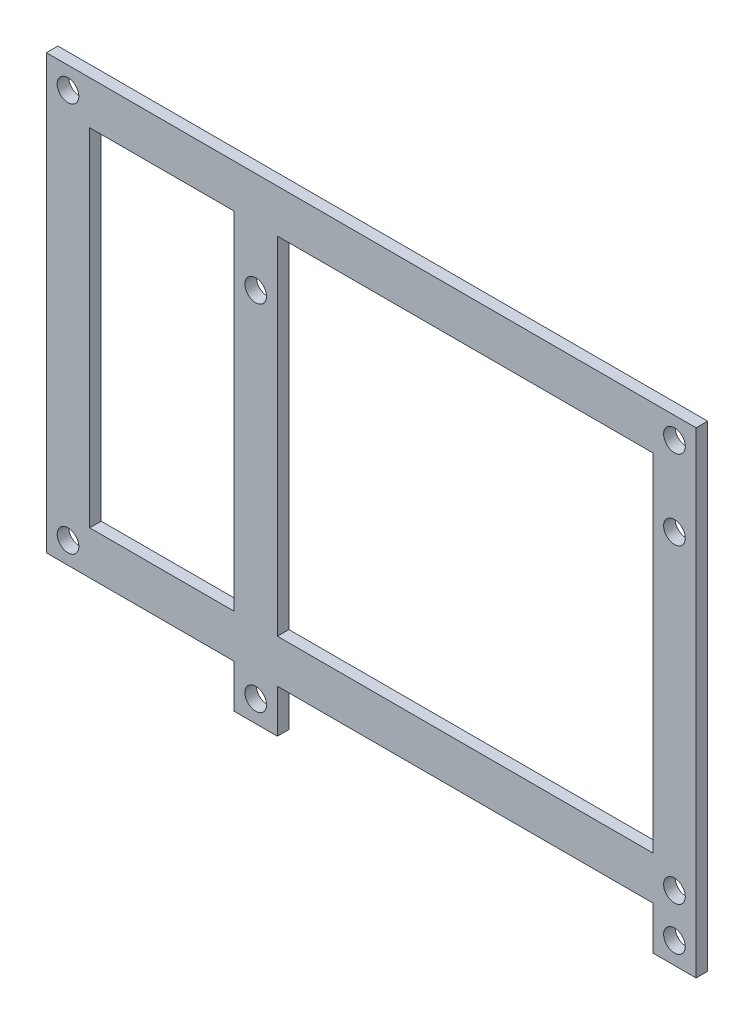
ISO-10303-21;
HEADER;
FILE_DESCRIPTION(('STEP AP214'),'2;1');
FILE_NAME('part.step','',(''),(''),'','','');
FILE_SCHEMA(('AUTOMOTIVE_DESIGN { 1 0 10303 214 1 1 1 1 }'));
ENDSEC;
DATA;
#1=APPLICATION_CONTEXT('core data for automotive mechanical design processes');
#2=APPLICATION_PROTOCOL_DEFINITION('international standard','automotive_design',2000,#1);
#3=PRODUCT_CONTEXT('',#1,'mechanical');
#4=PRODUCT('Part','Part','',(#3));
#5=PRODUCT_RELATED_PRODUCT_CATEGORY('part','',(#4));
#6=PRODUCT_DEFINITION_FORMATION('','',#4);
#7=PRODUCT_DEFINITION_CONTEXT('part definition',#1,'design');
#8=PRODUCT_DEFINITION('design','',#6,#7);
#9=PRODUCT_DEFINITION_SHAPE('','',#8);
#10=(LENGTH_UNIT() NAMED_UNIT(*) SI_UNIT(.MILLI.,.METRE.));
#11=(NAMED_UNIT(*) PLANE_ANGLE_UNIT() SI_UNIT($,.RADIAN.));
#12=(NAMED_UNIT(*) SI_UNIT($,.STERADIAN.) SOLID_ANGLE_UNIT());
#13=UNCERTAINTY_MEASURE_WITH_UNIT(LENGTH_MEASURE(1.E-05),#10,'distance_accuracy_value','');
#14=(GEOMETRIC_REPRESENTATION_CONTEXT(3) GLOBAL_UNCERTAINTY_ASSIGNED_CONTEXT((#13)) GLOBAL_UNIT_ASSIGNED_CONTEXT((#10,
#11,#12)) REPRESENTATION_CONTEXT('',''));
#15=CARTESIAN_POINT('',(0.,0.,0.));
#16=DIRECTION('',(0.,0.,1.));
#17=DIRECTION('',(1.,0.,0.));
#18=AXIS2_PLACEMENT_3D('',#15,#16,#17);
#19=CARTESIAN_POINT('',(-80.5873998938069,29.746992481203,0.));
#20=DIRECTION('',(0.,1.,0.));
#21=DIRECTION('',(0.,0.,1.));
#22=AXIS2_PLACEMENT_3D('',#19,#20,#21);
#23=PLANE('',#22);
#24=DIRECTION('',(-1.,0.,0.));
#25=VECTOR('',#24,1.);
#26=CARTESIAN_POINT('',(-80.5873998938069,29.746992481203,0.));
#27=LINE('',#26,#25);
#28=CARTESIAN_POINT('',(-60.5873998938069,29.746992481203,0.));
#29=VERTEX_POINT('',#28);
#30=CARTESIAN_POINT('',(-80.5873998938069,29.746992481203,0.));
#31=VERTEX_POINT('',#30);
#32=EDGE_CURVE('E51',#29,#31,#27,.T.);
#33=ORIENTED_EDGE('',*,*,#32,.F.);
#34=DIRECTION('',(0.,0.,1.));
#35=VECTOR('',#34,1.);
#36=CARTESIAN_POINT('',(-60.5873998938069,29.746992481203,0.));
#37=LINE('',#36,#35);
#38=CARTESIAN_POINT('',(-60.5873998938069,29.746992481203,1.59999999999994));
#39=VERTEX_POINT('',#38);
#40=EDGE_CURVE('E199',#29,#39,#37,.T.);
#41=ORIENTED_EDGE('',*,*,#40,.T.);
#42=DIRECTION('',(-1.,0.,0.));
#43=VECTOR('',#42,1.);
#44=CARTESIAN_POINT('',(-80.5873998938069,29.746992481203,1.59999999999994));
#45=LINE('',#44,#43);
#46=CARTESIAN_POINT('',(-80.5873998938069,29.746992481203,1.59999999999994));
#47=VERTEX_POINT('',#46);
#48=EDGE_CURVE('E266',#39,#47,#45,.T.);
#49=ORIENTED_EDGE('',*,*,#48,.T.);
#50=DIRECTION('',(0.,0.,1.));
#51=VECTOR('',#50,1.);
#52=CARTESIAN_POINT('',(-80.5873998938069,29.746992481203,0.));
#53=LINE('',#52,#51);
#54=EDGE_CURVE('E268',#31,#47,#53,.T.);
#55=ORIENTED_EDGE('',*,*,#54,.F.);
#56=EDGE_LOOP('',(#33,#41,#49,#55));
#57=FACE_BOUND('',#56,.T.);
#58=ADVANCED_FACE('F36',(#57),#23,.F.);
#59=CARTESIAN_POINT('',(-80.5873998938069,-18.253007518797,0.));
#60=DIRECTION('',(0.,-1.,0.));
#61=DIRECTION('',(0.,0.,-1.));
#62=AXIS2_PLACEMENT_3D('',#59,#60,#61);
#63=PLANE('',#62);
#64=DIRECTION('',(1.,0.,0.));
#65=VECTOR('',#64,1.);
#66=CARTESIAN_POINT('',(-80.5873998938069,-18.253007518797,1.59999999999994));
#67=LINE('',#66,#65);
#68=CARTESIAN_POINT('',(-80.5873998938069,-18.253007518797,1.59999999999994));
#69=VERTEX_POINT('',#68);
#70=CARTESIAN_POINT('',(-60.5873998938069,-18.253007518797,1.59999999999994));
#71=VERTEX_POINT('',#70);
#72=EDGE_CURVE('E175',#69,#71,#67,.T.);
#73=ORIENTED_EDGE('',*,*,#72,.T.);
#74=DIRECTION('',(0.,0.,1.));
#75=VECTOR('',#74,1.);
#76=CARTESIAN_POINT('',(-60.5873998938069,-18.253007518797,0.));
#77=LINE('',#76,#75);
#78=CARTESIAN_POINT('',(-60.5873998938069,-18.253007518797,0.));
#79=VERTEX_POINT('',#78);
#80=EDGE_CURVE('E185',#79,#71,#77,.T.);
#81=ORIENTED_EDGE('',*,*,#80,.F.);
#82=DIRECTION('',(1.,0.,0.));
#83=VECTOR('',#82,1.);
#84=CARTESIAN_POINT('',(-80.5873998938069,-18.253007518797,0.));
#85=LINE('',#84,#83);
#86=CARTESIAN_POINT('',(-80.5873998938069,-18.253007518797,0.));
#87=VERTEX_POINT('',#86);
#88=EDGE_CURVE('E255',#87,#79,#85,.T.);
#89=ORIENTED_EDGE('',*,*,#88,.F.);
#90=DIRECTION('',(0.,0.,1.));
#91=VECTOR('',#90,1.);
#92=CARTESIAN_POINT('',(-80.5873998938069,-18.253007518797,0.));
#93=LINE('',#92,#91);
#94=EDGE_CURVE('E263',#87,#69,#93,.T.);
#95=ORIENTED_EDGE('',*,*,#94,.T.);
#96=EDGE_LOOP('',(#73,#81,#89,#95));
#97=FACE_BOUND('',#96,.T.);
#98=ADVANCED_FACE('F416',(#97),#63,.F.);
#99=CARTESIAN_POINT('',(-86.5873998938069,-24.253007518797,1.59999999999994));
#100=DIRECTION('',(0.,1.,0.));
#101=DIRECTION('',(0.,0.,1.));
#102=AXIS2_PLACEMENT_3D('',#99,#100,#101);
#103=PLANE('',#102);
#104=DIRECTION('',(1.,0.,0.));
#105=VECTOR('',#104,1.);
#106=CARTESIAN_POINT('',(-86.5873998938069,-24.253007518797,0.));
#107=LINE('',#106,#105);
#108=CARTESIAN_POINT('',(-86.5873998938069,-24.253007518797,0.));
#109=VERTEX_POINT('',#108);
#110=CARTESIAN_POINT('',(-60.5873998938069,-24.253007518797,0.));
#111=VERTEX_POINT('',#110);
#112=EDGE_CURVE('E339',#109,#111,#107,.T.);
#113=ORIENTED_EDGE('',*,*,#112,.T.);
#114=DIRECTION('',(0.,0.,1.));
#115=VECTOR('',#114,1.);
#116=CARTESIAN_POINT('',(-60.5873998938069,-24.253007518797,0.));
#117=LINE('',#116,#115);
#118=CARTESIAN_POINT('',(-60.5873998938069,-24.253007518797,1.59999999999994));
#119=VERTEX_POINT('',#118);
#120=EDGE_CURVE('E223',#111,#119,#117,.T.);
#121=ORIENTED_EDGE('',*,*,#120,.T.);
#122=DIRECTION('',(1.,0.,0.));
#123=VECTOR('',#122,1.);
#124=CARTESIAN_POINT('',(-86.5873998938069,-24.253007518797,1.59999999999994));
#125=LINE('',#124,#123);
#126=CARTESIAN_POINT('',(-86.5873998938069,-24.253007518797,1.59999999999994));
#127=VERTEX_POINT('',#126);
#128=EDGE_CURVE('E388',#127,#119,#125,.T.);
#129=ORIENTED_EDGE('',*,*,#128,.F.);
#130=DIRECTION('',(0.,0.,-1.));
#131=VECTOR('',#130,1.);
#132=CARTESIAN_POINT('',(-86.5873998938069,-24.253007518797,1.59999999999994));
#133=LINE('',#132,#131);
#134=EDGE_CURVE('E12',#127,#109,#133,.T.);
#135=ORIENTED_EDGE('',*,*,#134,.T.);
#136=EDGE_LOOP('',(#113,#121,#129,#135));
#137=FACE_BOUND('',#136,.T.);
#138=ADVANCED_FACE('F394',(#137),#103,.F.);
#139=CARTESIAN_POINT('',(-86.5873998938069,35.746992481203,1.59999999999994));
#140=DIRECTION('',(1.,0.,0.));
#141=DIRECTION('',(0.,1.,0.));
#142=AXIS2_PLACEMENT_3D('',#139,#140,#141);
#143=PLANE('',#142);
#144=DIRECTION('',(0.,-1.,0.));
#145=VECTOR('',#144,1.);
#146=CARTESIAN_POINT('',(-86.5873998938069,35.746992481203,0.));
#147=LINE('',#146,#145);
#148=CARTESIAN_POINT('',(-86.5873998938069,35.746992481203,0.));
#149=VERTEX_POINT('',#148);
#150=EDGE_CURVE('E303',#149,#109,#147,.T.);
#151=ORIENTED_EDGE('',*,*,#150,.T.);
#152=ORIENTED_EDGE('',*,*,#134,.F.);
#153=DIRECTION('',(0.,-1.,0.));
#154=VECTOR('',#153,1.);
#155=CARTESIAN_POINT('',(-86.5873998938069,35.746992481203,1.59999999999994));
#156=LINE('',#155,#154);
#157=CARTESIAN_POINT('',(-86.5873998938069,35.746992481203,1.59999999999994));
#158=VERTEX_POINT('',#157);
#159=EDGE_CURVE('E308',#158,#127,#156,.T.);
#160=ORIENTED_EDGE('',*,*,#159,.F.);
#161=DIRECTION('',(0.,0.,-1.));
#162=VECTOR('',#161,1.);
#163=CARTESIAN_POINT('',(-86.5873998938069,35.746992481203,1.59999999999994));
#164=LINE('',#163,#162);
#165=EDGE_CURVE('E351',#158,#149,#164,.T.);
#166=ORIENTED_EDGE('',*,*,#165,.T.);
#167=EDGE_LOOP('',(#151,#152,#160,#166));
#168=FACE_BOUND('',#167,.T.);
#169=ADVANCED_FACE('F38',(#168),#143,.F.);
#170=CARTESIAN_POINT('',(-54.5873998938069,-24.253007518797,1.59999999999994));
#171=VERTEX_POINT('',#170);
#172=CARTESIAN_POINT('',(-2.58739989380696,-24.253007518797,1.59999999999994));
#173=VERTEX_POINT('',#172);
#174=EDGE_CURVE('E386',#171,#173,#125,.T.);
#175=ORIENTED_EDGE('',*,*,#174,.F.);
#176=DIRECTION('',(0.,0.,1.));
#177=VECTOR('',#176,1.);
#178=CARTESIAN_POINT('',(-54.5873998938069,-24.253007518797,0.));
#179=LINE('',#178,#177);
#180=CARTESIAN_POINT('',(-54.5873998938069,-24.253007518797,0.));
#181=VERTEX_POINT('',#180);
#182=EDGE_CURVE('E226',#181,#171,#179,.T.);
#183=ORIENTED_EDGE('',*,*,#182,.F.);
#184=CARTESIAN_POINT('',(-2.58739989380694,-24.253007518797,0.));
#185=VERTEX_POINT('',#184);
#186=EDGE_CURVE('E343',#181,#185,#107,.T.);
#187=ORIENTED_EDGE('',*,*,#186,.T.);
#188=DIRECTION('',(0.,0.,1.));
#189=VECTOR('',#188,1.);
#190=CARTESIAN_POINT('',(-2.58739989380694,-24.253007518797,0.));
#191=LINE('',#190,#189);
#192=EDGE_CURVE('E239',#185,#173,#191,.T.);
#193=ORIENTED_EDGE('',*,*,#192,.T.);
#194=EDGE_LOOP('',(#175,#183,#187,#193));
#195=FACE_BOUND('',#194,.T.);
#196=ADVANCED_FACE('F375',(#195),#103,.F.);
#197=CARTESIAN_POINT('',(3.41260010619306,35.746992481203,1.59999999999994));
#198=DIRECTION('',(-1.,0.,0.));
#199=DIRECTION('',(0.,0.,1.));
#200=AXIS2_PLACEMENT_3D('',#197,#198,#199);
#201=PLANE('',#200);
#202=DIRECTION('',(0.,1.,0.));
#203=VECTOR('',#202,1.);
#204=CARTESIAN_POINT('',(3.41260010619306,35.746992481203,0.));
#205=LINE('',#204,#203);
#206=CARTESIAN_POINT('',(3.41260010619306,-30.253007518797,0.));
#207=VERTEX_POINT('',#206);
#208=CARTESIAN_POINT('',(3.41260010619306,35.746992481203,0.));
#209=VERTEX_POINT('',#208);
#210=EDGE_CURVE('E342',#207,#209,#205,.T.);
#211=ORIENTED_EDGE('',*,*,#210,.T.);
#212=DIRECTION('',(0.,0.,-1.));
#213=VECTOR('',#212,1.);
#214=CARTESIAN_POINT('',(3.41260010619306,35.746992481203,1.59999999999994));
#215=LINE('',#214,#213);
#216=CARTESIAN_POINT('',(3.41260010619306,35.746992481203,1.59999999999994));
#217=VERTEX_POINT('',#216);
#218=EDGE_CURVE('E44',#217,#209,#215,.T.);
#219=ORIENTED_EDGE('',*,*,#218,.F.);
#220=DIRECTION('',(0.,1.,0.));
#221=VECTOR('',#220,1.);
#222=CARTESIAN_POINT('',(3.41260010619306,35.746992481203,1.59999999999994));
#223=LINE('',#222,#221);
#224=CARTESIAN_POINT('',(3.41260010619306,-30.253007518797,1.59999999999994));
#225=VERTEX_POINT('',#224);
#226=EDGE_CURVE('E390',#225,#217,#223,.T.);
#227=ORIENTED_EDGE('',*,*,#226,.F.);
#228=DIRECTION('',(0.,0.,1.));
#229=VECTOR('',#228,1.);
#230=CARTESIAN_POINT('',(3.41260010619306,-30.253007518797,0.));
#231=LINE('',#230,#229);
#232=EDGE_CURVE('E244',#207,#225,#231,.T.);
#233=ORIENTED_EDGE('',*,*,#232,.F.);
#234=EDGE_LOOP('',(#211,#219,#227,#233));
#235=FACE_BOUND('',#234,.T.);
#236=ADVANCED_FACE('F504',(#235),#201,.F.);
#237=CARTESIAN_POINT('',(-86.5873998938069,35.746992481203,1.59999999999994));
#238=DIRECTION('',(0.,-1.,0.));
#239=DIRECTION('',(0.,0.,-1.));
#240=AXIS2_PLACEMENT_3D('',#237,#238,#239);
#241=PLANE('',#240);
#242=DIRECTION('',(-1.,0.,0.));
#243=VECTOR('',#242,1.);
#244=CARTESIAN_POINT('',(-86.5873998938069,35.746992481203,0.));
#245=LINE('',#244,#243);
#246=EDGE_CURVE('E348',#209,#149,#245,.T.);
#247=ORIENTED_EDGE('',*,*,#246,.T.);
#248=ORIENTED_EDGE('',*,*,#165,.F.);
#249=DIRECTION('',(-1.,0.,0.));
#250=VECTOR('',#249,1.);
#251=CARTESIAN_POINT('',(-86.5873998938069,35.746992481203,1.59999999999994));
#252=LINE('',#251,#250);
#253=EDGE_CURVE('E354',#217,#158,#252,.T.);
#254=ORIENTED_EDGE('',*,*,#253,.F.);
#255=ORIENTED_EDGE('',*,*,#218,.T.);
#256=EDGE_LOOP('',(#247,#248,#254,#255));
#257=FACE_BOUND('',#256,.T.);
#258=ADVANCED_FACE('F360',(#257),#241,.F.);
#259=CARTESIAN_POINT('',(-31.3944174376666,8.37857142857143,1.59999999999994));
#260=DIRECTION('',(0.,0.,1.));
#261=DIRECTION('',(1.,0.,0.));
#262=AXIS2_PLACEMENT_3D('',#259,#260,#261);
#263=PLANE('',#262);
#264=CARTESIAN_POINT('',(-57.587399893807,-27.2530075187974,1.59999999999994));
#265=DIRECTION('',(0.,0.,1.));
#266=DIRECTION('',(1.,0.,0.));
#267=AXIS2_PLACEMENT_3D('',#264,#265,#266);
#268=CIRCLE('',#267,1.5);
#269=CARTESIAN_POINT('',(-56.087399893807,-27.2530075187974,1.59999999999994));
#270=VERTEX_POINT('',#269);
#271=EDGE_CURVE('E454',#270,#270,#268,.T.);
#272=ORIENTED_EDGE('',*,*,#271,.F.);
#273=EDGE_LOOP('',(#272));
#274=FACE_BOUND('',#273,.T.);
#275=CARTESIAN_POINT('',(0.412600106192866,21.746992481203,1.59999999999994));
#276=DIRECTION('',(0.,0.,1.));
#277=DIRECTION('',(1.,0.,0.));
#278=AXIS2_PLACEMENT_3D('',#275,#276,#277);
#279=CIRCLE('',#278,1.5);
#280=CARTESIAN_POINT('',(1.91260010619287,21.746992481203,1.59999999999994));
#281=VERTEX_POINT('',#280);
#282=EDGE_CURVE('E447',#281,#281,#279,.T.);
#283=ORIENTED_EDGE('',*,*,#282,.F.);
#284=EDGE_LOOP('',(#283));
#285=FACE_BOUND('',#284,.T.);
#286=CARTESIAN_POINT('',(-57.5873998938071,21.7469924812026,1.59999999999994));
#287=DIRECTION('',(0.,0.,1.));
#288=DIRECTION('',(1.,0.,0.));
#289=AXIS2_PLACEMENT_3D('',#286,#287,#288);
#290=CIRCLE('',#289,1.5);
#291=CARTESIAN_POINT('',(-56.0873998938071,21.7469924812026,1.59999999999994));
#292=VERTEX_POINT('',#291);
#293=EDGE_CURVE('E459',#292,#292,#290,.T.);
#294=ORIENTED_EDGE('',*,*,#293,.F.);
#295=EDGE_LOOP('',(#294));
#296=FACE_BOUND('',#295,.T.);
#297=CARTESIAN_POINT('',(0.412600106193037,-27.253007518797,1.59999999999994));
#298=DIRECTION('',(0.,0.,1.));
#299=DIRECTION('',(1.,0.,0.));
#300=AXIS2_PLACEMENT_3D('',#297,#298,#299);
#301=CIRCLE('',#300,1.5);
#302=CARTESIAN_POINT('',(1.91260010619304,-27.253007518797,1.59999999999994));
#303=VERTEX_POINT('',#302);
#304=EDGE_CURVE('E441',#303,#303,#301,.T.);
#305=ORIENTED_EDGE('',*,*,#304,.F.);
#306=EDGE_LOOP('',(#305));
#307=FACE_BOUND('',#306,.T.);
#308=ORIENTED_EDGE('',*,*,#48,.F.);
#309=DIRECTION('',(0.,-1.,0.));
#310=VECTOR('',#309,1.);
#311=CARTESIAN_POINT('',(-60.5873998938069,-18.253007518797,1.59999999999994));
#312=LINE('',#311,#310);
#313=EDGE_CURVE('E189',#39,#71,#312,.T.);
#314=ORIENTED_EDGE('',*,*,#313,.T.);
#315=ORIENTED_EDGE('',*,*,#72,.F.);
#316=DIRECTION('',(0.,-1.,0.));
#317=VECTOR('',#316,1.);
#318=CARTESIAN_POINT('',(-80.5873998938069,29.746992481203,1.59999999999994));
#319=LINE('',#318,#317);
#320=EDGE_CURVE('E176',#47,#69,#319,.T.);
#321=ORIENTED_EDGE('',*,*,#320,.F.);
#322=EDGE_LOOP('',(#308,#314,#315,#321));
#323=FACE_BOUND('',#322,.T.);
#324=DIRECTION('',(0.,1.,0.));
#325=VECTOR('',#324,1.);
#326=CARTESIAN_POINT('',(-54.5873998938069,-18.253007518797,1.59999999999994));
#327=LINE('',#326,#325);
#328=CARTESIAN_POINT('',(-54.5873998938069,-18.253007518797,1.59999999999994));
#329=VERTEX_POINT('',#328);
#330=CARTESIAN_POINT('',(-54.5873998938069,29.746992481203,1.59999999999994));
#331=VERTEX_POINT('',#330);
#332=EDGE_CURVE('E169',#329,#331,#327,.T.);
#333=ORIENTED_EDGE('',*,*,#332,.T.);
#334=CARTESIAN_POINT('',(-2.58739989380694,29.746992481203,1.59999999999994));
#335=VERTEX_POINT('',#334);
#336=EDGE_CURVE('E254',#335,#331,#45,.T.);
#337=ORIENTED_EDGE('',*,*,#336,.F.);
#338=DIRECTION('',(0.,1.,0.));
#339=VECTOR('',#338,1.);
#340=CARTESIAN_POINT('',(-2.58739989380694,29.746992481203,1.59999999999994));
#341=LINE('',#340,#339);
#342=CARTESIAN_POINT('',(-2.58739989380694,-18.253007518797,1.59999999999994));
#343=VERTEX_POINT('',#342);
#344=EDGE_CURVE('E171',#343,#335,#341,.T.);
#345=ORIENTED_EDGE('',*,*,#344,.F.);
#346=EDGE_CURVE('E163',#329,#343,#67,.T.);
#347=ORIENTED_EDGE('',*,*,#346,.F.);
#348=EDGE_LOOP('',(#333,#337,#345,#347));
#349=FACE_BOUND('',#348,.T.);
#350=CARTESIAN_POINT('',(-83.5873998938069,32.746992481203,1.59999999999994));
#351=DIRECTION('',(0.,0.,-1.));
#352=DIRECTION('',(-1.,0.,0.));
#353=AXIS2_PLACEMENT_3D('',#350,#351,#352);
#354=CIRCLE('',#353,1.5);
#355=CARTESIAN_POINT('',(-85.0873998938069,32.746992481203,1.59999999999994));
#356=VERTEX_POINT('',#355);
#357=EDGE_CURVE('E300',#356,#356,#354,.T.);
#358=ORIENTED_EDGE('',*,*,#357,.T.);
#359=EDGE_LOOP('',(#358));
#360=FACE_BOUND('',#359,.T.);
#361=CARTESIAN_POINT('',(0.412600106192505,-21.2530075187976,1.59999999999994));
#362=DIRECTION('',(0.,0.,-1.));
#363=DIRECTION('',(-1.,0.,0.));
#364=AXIS2_PLACEMENT_3D('',#361,#362,#363);
#365=CIRCLE('',#364,1.5);
#366=CARTESIAN_POINT('',(-1.0873998938075,-21.2530075187976,1.59999999999994));
#367=VERTEX_POINT('',#366);
#368=EDGE_CURVE('E278',#367,#367,#365,.T.);
#369=ORIENTED_EDGE('',*,*,#368,.T.);
#370=EDGE_LOOP('',(#369));
#371=FACE_BOUND('',#370,.T.);
#372=CARTESIAN_POINT('',(-83.5873998938075,-21.253007518797,1.59999999999994));
#373=DIRECTION('',(0.,0.,-1.));
#374=DIRECTION('',(-1.,0.,0.));
#375=AXIS2_PLACEMENT_3D('',#372,#373,#374);
#376=CIRCLE('',#375,1.5);
#377=CARTESIAN_POINT('',(-85.0873998938075,-21.253007518797,1.59999999999994));
#378=VERTEX_POINT('',#377);
#379=EDGE_CURVE('E299',#378,#378,#376,.T.);
#380=ORIENTED_EDGE('',*,*,#379,.T.);
#381=EDGE_LOOP('',(#380));
#382=FACE_BOUND('',#381,.T.);
#383=CARTESIAN_POINT('',(0.412600106193074,32.7469924812024,1.59999999999994));
#384=DIRECTION('',(0.,0.,-1.));
#385=DIRECTION('',(-1.,0.,0.));
#386=AXIS2_PLACEMENT_3D('',#383,#384,#385);
#387=CIRCLE('',#386,1.5);
#388=CARTESIAN_POINT('',(-1.08739989380693,32.7469924812024,1.59999999999994));
#389=VERTEX_POINT('',#388);
#390=EDGE_CURVE('E285',#389,#389,#387,.T.);
#391=ORIENTED_EDGE('',*,*,#390,.T.);
#392=EDGE_LOOP('',(#391));
#393=FACE_BOUND('',#392,.T.);
#394=ORIENTED_EDGE('',*,*,#159,.T.);
#395=ORIENTED_EDGE('',*,*,#128,.T.);
#396=DIRECTION('',(0.,-1.,0.));
#397=VECTOR('',#396,1.);
#398=CARTESIAN_POINT('',(-60.5873998938069,-24.253007518797,1.59999999999994));
#399=LINE('',#398,#397);
#400=CARTESIAN_POINT('',(-60.5873998938069,-30.253007518797,1.59999999999994));
#401=VERTEX_POINT('',#400);
#402=EDGE_CURVE('E201',#119,#401,#399,.T.);
#403=ORIENTED_EDGE('',*,*,#402,.T.);
#404=DIRECTION('',(1.,0.,0.));
#405=VECTOR('',#404,1.);
#406=CARTESIAN_POINT('',(-60.5873998938069,-30.253007518797,1.59999999999994));
#407=LINE('',#406,#405);
#408=CARTESIAN_POINT('',(-54.5873998938069,-30.253007518797,1.59999999999994));
#409=VERTEX_POINT('',#408);
#410=EDGE_CURVE('E218',#401,#409,#407,.T.);
#411=ORIENTED_EDGE('',*,*,#410,.T.);
#412=DIRECTION('',(0.,1.,0.));
#413=VECTOR('',#412,1.);
#414=CARTESIAN_POINT('',(-54.5873998938069,-24.253007518797,1.59999999999994));
#415=LINE('',#414,#413);
#416=EDGE_CURVE('E209',#409,#171,#415,.T.);
#417=ORIENTED_EDGE('',*,*,#416,.T.);
#418=ORIENTED_EDGE('',*,*,#174,.T.);
#419=DIRECTION('',(0.,-1.,0.));
#420=VECTOR('',#419,1.);
#421=CARTESIAN_POINT('',(-2.58739989380694,-24.253007518797,1.59999999999994));
#422=LINE('',#421,#420);
#423=CARTESIAN_POINT('',(-2.58739989380694,-30.253007518797,1.59999999999994));
#424=VERTEX_POINT('',#423);
#425=EDGE_CURVE('E225',#173,#424,#422,.T.);
#426=ORIENTED_EDGE('',*,*,#425,.T.);
#427=DIRECTION('',(1.,0.,0.));
#428=VECTOR('',#427,1.);
#429=CARTESIAN_POINT('',(3.41260010619306,-30.253007518797,1.59999999999994));
#430=LINE('',#429,#428);
#431=EDGE_CURVE('E236',#424,#225,#430,.T.);
#432=ORIENTED_EDGE('',*,*,#431,.T.);
#433=ORIENTED_EDGE('',*,*,#226,.T.);
#434=ORIENTED_EDGE('',*,*,#253,.T.);
#435=EDGE_LOOP('',(#394,#395,#403,#411,#417,#418,#426,#432,#433,#434));
#436=FACE_BOUND('',#435,.T.);
#437=ADVANCED_FACE('F165',(#274,#285,#296,#307,#323,#349,#360,#371,#382,#393,#436),#263,.T.);
#438=CARTESIAN_POINT('',(-31.3944174376666,8.37857142857143,0.));
#439=DIRECTION('',(0.,0.,1.));
#440=DIRECTION('',(1.,0.,0.));
#441=AXIS2_PLACEMENT_3D('',#438,#439,#440);
#442=PLANE('',#441);
#443=CARTESIAN_POINT('',(-57.587399893807,-27.2530075187974,0.));
#444=DIRECTION('',(0.,0.,1.));
#445=DIRECTION('',(1.,0.,0.));
#446=AXIS2_PLACEMENT_3D('',#443,#444,#445);
#447=CIRCLE('',#446,1.5);
#448=CARTESIAN_POINT('',(-56.087399893807,-27.2530075187974,0.));
#449=VERTEX_POINT('',#448);
#450=EDGE_CURVE('E444',#449,#449,#447,.T.);
#451=ORIENTED_EDGE('',*,*,#450,.T.);
#452=EDGE_LOOP('',(#451));
#453=FACE_BOUND('',#452,.T.);
#454=CARTESIAN_POINT('',(0.412600106192866,21.746992481203,0.));
#455=DIRECTION('',(0.,0.,1.));
#456=DIRECTION('',(1.,0.,0.));
#457=AXIS2_PLACEMENT_3D('',#454,#455,#456);
#458=CIRCLE('',#457,1.5);
#459=CARTESIAN_POINT('',(1.91260010619287,21.746992481203,0.));
#460=VERTEX_POINT('',#459);
#461=EDGE_CURVE('E450',#460,#460,#458,.T.);
#462=ORIENTED_EDGE('',*,*,#461,.T.);
#463=EDGE_LOOP('',(#462));
#464=FACE_BOUND('',#463,.T.);
#465=CARTESIAN_POINT('',(-57.5873998938071,21.7469924812026,0.));
#466=DIRECTION('',(0.,0.,1.));
#467=DIRECTION('',(1.,0.,0.));
#468=AXIS2_PLACEMENT_3D('',#465,#466,#467);
#469=CIRCLE('',#468,1.5);
#470=CARTESIAN_POINT('',(-56.0873998938071,21.7469924812026,0.));
#471=VERTEX_POINT('',#470);
#472=EDGE_CURVE('E451',#471,#471,#469,.T.);
#473=ORIENTED_EDGE('',*,*,#472,.T.);
#474=EDGE_LOOP('',(#473));
#475=FACE_BOUND('',#474,.T.);
#476=CARTESIAN_POINT('',(0.412600106193037,-27.253007518797,0.));
#477=DIRECTION('',(0.,0.,1.));
#478=DIRECTION('',(1.,0.,0.));
#479=AXIS2_PLACEMENT_3D('',#476,#477,#478);
#480=CIRCLE('',#479,1.5);
#481=CARTESIAN_POINT('',(1.91260010619304,-27.253007518797,0.));
#482=VERTEX_POINT('',#481);
#483=EDGE_CURVE('E195',#482,#482,#480,.T.);
#484=ORIENTED_EDGE('',*,*,#483,.T.);
#485=EDGE_LOOP('',(#484));
#486=FACE_BOUND('',#485,.T.);
#487=DIRECTION('',(0.,-1.,0.));
#488=VECTOR('',#487,1.);
#489=CARTESIAN_POINT('',(-60.5873998938069,-18.253007518797,0.));
#490=LINE('',#489,#488);
#491=EDGE_CURVE('E188',#29,#79,#490,.T.);
#492=ORIENTED_EDGE('',*,*,#491,.F.);
#493=ORIENTED_EDGE('',*,*,#32,.T.);
#494=DIRECTION('',(0.,-1.,0.));
#495=VECTOR('',#494,1.);
#496=CARTESIAN_POINT('',(-80.5873998938069,29.746992481203,0.));
#497=LINE('',#496,#495);
#498=EDGE_CURVE('E251',#31,#87,#497,.T.);
#499=ORIENTED_EDGE('',*,*,#498,.T.);
#500=ORIENTED_EDGE('',*,*,#88,.T.);
#501=EDGE_LOOP('',(#492,#493,#499,#500));
#502=FACE_BOUND('',#501,.T.);
#503=CARTESIAN_POINT('',(-2.58739989380694,29.746992481203,0.));
#504=VERTEX_POINT('',#503);
#505=CARTESIAN_POINT('',(-54.5873998938069,29.746992481203,0.));
#506=VERTEX_POINT('',#505);
#507=EDGE_CURVE('E261',#504,#506,#27,.T.);
#508=ORIENTED_EDGE('',*,*,#507,.T.);
#509=DIRECTION('',(0.,1.,0.));
#510=VECTOR('',#509,1.);
#511=CARTESIAN_POINT('',(-54.5873998938069,-18.253007518797,0.));
#512=LINE('',#511,#510);
#513=CARTESIAN_POINT('',(-54.5873998938069,-18.253007518797,0.));
#514=VERTEX_POINT('',#513);
#515=EDGE_CURVE('E192',#514,#506,#512,.T.);
#516=ORIENTED_EDGE('',*,*,#515,.F.);
#517=CARTESIAN_POINT('',(-2.58739989380694,-18.253007518797,0.));
#518=VERTEX_POINT('',#517);
#519=EDGE_CURVE('E181',#514,#518,#85,.T.);
#520=ORIENTED_EDGE('',*,*,#519,.T.);
#521=DIRECTION('',(0.,1.,0.));
#522=VECTOR('',#521,1.);
#523=CARTESIAN_POINT('',(-2.58739989380694,29.746992481203,0.));
#524=LINE('',#523,#522);
#525=EDGE_CURVE('E258',#518,#504,#524,.T.);
#526=ORIENTED_EDGE('',*,*,#525,.T.);
#527=EDGE_LOOP('',(#508,#516,#520,#526));
#528=FACE_BOUND('',#527,.T.);
#529=CARTESIAN_POINT('',(-83.5873998938069,32.746992481203,0.));
#530=DIRECTION('',(0.,0.,-1.));
#531=DIRECTION('',(-1.,0.,0.));
#532=AXIS2_PLACEMENT_3D('',#529,#530,#531);
#533=CIRCLE('',#532,1.5);
#534=CARTESIAN_POINT('',(-85.0873998938069,32.746992481203,0.));
#535=VERTEX_POINT('',#534);
#536=EDGE_CURVE('E304',#535,#535,#533,.T.);
#537=ORIENTED_EDGE('',*,*,#536,.F.);
#538=EDGE_LOOP('',(#537));
#539=FACE_BOUND('',#538,.T.);
#540=CARTESIAN_POINT('',(0.412600106192505,-21.2530075187976,0.));
#541=DIRECTION('',(0.,0.,-1.));
#542=DIRECTION('',(-1.,0.,0.));
#543=AXIS2_PLACEMENT_3D('',#540,#541,#542);
#544=CIRCLE('',#543,1.5);
#545=CARTESIAN_POINT('',(-1.0873998938075,-21.2530075187976,0.));
#546=VERTEX_POINT('',#545);
#547=EDGE_CURVE('E271',#546,#546,#544,.T.);
#548=ORIENTED_EDGE('',*,*,#547,.F.);
#549=EDGE_LOOP('',(#548));
#550=FACE_BOUND('',#549,.T.);
#551=CARTESIAN_POINT('',(-83.5873998938075,-21.253007518797,0.));
#552=DIRECTION('',(0.,0.,-1.));
#553=DIRECTION('',(-1.,0.,0.));
#554=AXIS2_PLACEMENT_3D('',#551,#552,#553);
#555=CIRCLE('',#554,1.5);
#556=CARTESIAN_POINT('',(-85.0873998938075,-21.253007518797,0.));
#557=VERTEX_POINT('',#556);
#558=EDGE_CURVE('E281',#557,#557,#555,.T.);
#559=ORIENTED_EDGE('',*,*,#558,.F.);
#560=EDGE_LOOP('',(#559));
#561=FACE_BOUND('',#560,.T.);
#562=CARTESIAN_POINT('',(0.412600106193074,32.7469924812024,0.));
#563=DIRECTION('',(0.,0.,-1.));
#564=DIRECTION('',(-1.,0.,0.));
#565=AXIS2_PLACEMENT_3D('',#562,#563,#564);
#566=CIRCLE('',#565,1.5);
#567=CARTESIAN_POINT('',(-1.08739989380693,32.7469924812024,0.));
#568=VERTEX_POINT('',#567);
#569=EDGE_CURVE('E735',#568,#568,#566,.T.);
#570=ORIENTED_EDGE('',*,*,#569,.F.);
#571=EDGE_LOOP('',(#570));
#572=FACE_BOUND('',#571,.T.);
#573=ORIENTED_EDGE('',*,*,#150,.F.);
#574=ORIENTED_EDGE('',*,*,#246,.F.);
#575=ORIENTED_EDGE('',*,*,#210,.F.);
#576=DIRECTION('',(1.,0.,0.));
#577=VECTOR('',#576,1.);
#578=CARTESIAN_POINT('',(3.41260010619306,-30.253007518797,0.));
#579=LINE('',#578,#577);
#580=CARTESIAN_POINT('',(-2.58739989380694,-30.253007518797,0.));
#581=VERTEX_POINT('',#580);
#582=EDGE_CURVE('E235',#581,#207,#579,.T.);
#583=ORIENTED_EDGE('',*,*,#582,.F.);
#584=DIRECTION('',(0.,-1.,0.));
#585=VECTOR('',#584,1.);
#586=CARTESIAN_POINT('',(-2.58739989380694,-24.253007518797,0.));
#587=LINE('',#586,#585);
#588=EDGE_CURVE('E232',#185,#581,#587,.T.);
#589=ORIENTED_EDGE('',*,*,#588,.F.);
#590=ORIENTED_EDGE('',*,*,#186,.F.);
#591=DIRECTION('',(0.,1.,0.));
#592=VECTOR('',#591,1.);
#593=CARTESIAN_POINT('',(-54.5873998938069,-24.253007518797,0.));
#594=LINE('',#593,#592);
#595=CARTESIAN_POINT('',(-54.5873998938069,-30.253007518797,0.));
#596=VERTEX_POINT('',#595);
#597=EDGE_CURVE('E212',#596,#181,#594,.T.);
#598=ORIENTED_EDGE('',*,*,#597,.F.);
#599=DIRECTION('',(1.,0.,0.));
#600=VECTOR('',#599,1.);
#601=CARTESIAN_POINT('',(-60.5873998938069,-30.253007518797,0.));
#602=LINE('',#601,#600);
#603=CARTESIAN_POINT('',(-60.5873998938069,-30.253007518797,0.));
#604=VERTEX_POINT('',#603);
#605=EDGE_CURVE('E208',#604,#596,#602,.T.);
#606=ORIENTED_EDGE('',*,*,#605,.F.);
#607=DIRECTION('',(0.,-1.,0.));
#608=VECTOR('',#607,1.);
#609=CARTESIAN_POINT('',(-60.5873998938069,-24.253007518797,0.));
#610=LINE('',#609,#608);
#611=EDGE_CURVE('E205',#111,#604,#610,.T.);
#612=ORIENTED_EDGE('',*,*,#611,.F.);
#613=ORIENTED_EDGE('',*,*,#112,.F.);
#614=EDGE_LOOP('',(#573,#574,#575,#583,#589,#590,#598,#606,#612,#613));
#615=FACE_BOUND('',#614,.T.);
#616=ADVANCED_FACE('F365',(#453,#464,#475,#486,#502,#528,#539,#550,#561,#572,#615),#442,.F.);
#617=CARTESIAN_POINT('',(0.412600106193074,32.7469924812024,1.59999999999994));
#618=DIRECTION('',(0.,0.,-1.));
#619=DIRECTION('',(-1.,0.,0.));
#620=AXIS2_PLACEMENT_3D('',#617,#618,#619);
#621=CYLINDRICAL_SURFACE('',#620,1.5);
#622=ORIENTED_EDGE('',*,*,#390,.F.);
#623=EDGE_LOOP('',(#622));
#624=FACE_BOUND('',#623,.T.);
#625=ORIENTED_EDGE('',*,*,#569,.T.);
#626=EDGE_LOOP('',(#625));
#627=FACE_BOUND('',#626,.T.);
#628=ADVANCED_FACE('F490',(#624,#627),#621,.F.);
#629=CARTESIAN_POINT('',(-83.5873998938075,-21.253007518797,1.59999999999994));
#630=DIRECTION('',(0.,0.,-1.));
#631=DIRECTION('',(-1.,0.,0.));
#632=AXIS2_PLACEMENT_3D('',#629,#630,#631);
#633=CYLINDRICAL_SURFACE('',#632,1.5);
#634=ORIENTED_EDGE('',*,*,#379,.F.);
#635=EDGE_LOOP('',(#634));
#636=FACE_BOUND('',#635,.T.);
#637=ORIENTED_EDGE('',*,*,#558,.T.);
#638=EDGE_LOOP('',(#637));
#639=FACE_BOUND('',#638,.T.);
#640=ADVANCED_FACE('F496',(#636,#639),#633,.F.);
#641=CARTESIAN_POINT('',(0.412600106192505,-21.2530075187976,1.59999999999994));
#642=DIRECTION('',(0.,0.,-1.));
#643=DIRECTION('',(-1.,0.,0.));
#644=AXIS2_PLACEMENT_3D('',#641,#642,#643);
#645=CYLINDRICAL_SURFACE('',#644,1.5);
#646=ORIENTED_EDGE('',*,*,#368,.F.);
#647=EDGE_LOOP('',(#646));
#648=FACE_BOUND('',#647,.T.);
#649=ORIENTED_EDGE('',*,*,#547,.T.);
#650=EDGE_LOOP('',(#649));
#651=FACE_BOUND('',#650,.T.);
#652=ADVANCED_FACE('F545',(#648,#651),#645,.F.);
#653=CARTESIAN_POINT('',(-83.5873998938069,32.746992481203,1.59999999999994));
#654=DIRECTION('',(0.,0.,-1.));
#655=DIRECTION('',(-1.,0.,0.));
#656=AXIS2_PLACEMENT_3D('',#653,#654,#655);
#657=CYLINDRICAL_SURFACE('',#656,1.5);
#658=ORIENTED_EDGE('',*,*,#357,.F.);
#659=EDGE_LOOP('',(#658));
#660=FACE_BOUND('',#659,.T.);
#661=ORIENTED_EDGE('',*,*,#536,.T.);
#662=EDGE_LOOP('',(#661));
#663=FACE_BOUND('',#662,.T.);
#664=ADVANCED_FACE('F434',(#660,#663),#657,.F.);
#665=CARTESIAN_POINT('',(-80.5873998938069,29.746992481203,0.));
#666=DIRECTION('',(-1.,0.,0.));
#667=DIRECTION('',(0.,0.,1.));
#668=AXIS2_PLACEMENT_3D('',#665,#666,#667);
#669=PLANE('',#668);
#670=ORIENTED_EDGE('',*,*,#320,.T.);
#671=ORIENTED_EDGE('',*,*,#94,.F.);
#672=ORIENTED_EDGE('',*,*,#498,.F.);
#673=ORIENTED_EDGE('',*,*,#54,.T.);
#674=EDGE_LOOP('',(#670,#671,#672,#673));
#675=FACE_BOUND('',#674,.T.);
#676=ADVANCED_FACE('F428',(#675),#669,.F.);
#677=ORIENTED_EDGE('',*,*,#336,.T.);
#678=DIRECTION('',(0.,0.,1.));
#679=VECTOR('',#678,1.);
#680=CARTESIAN_POINT('',(-54.5873998938069,29.746992481203,0.));
#681=LINE('',#680,#679);
#682=EDGE_CURVE('E59',#506,#331,#681,.T.);
#683=ORIENTED_EDGE('',*,*,#682,.F.);
#684=ORIENTED_EDGE('',*,*,#507,.F.);
#685=DIRECTION('',(0.,0.,1.));
#686=VECTOR('',#685,1.);
#687=CARTESIAN_POINT('',(-2.58739989380694,29.746992481203,0.));
#688=LINE('',#687,#686);
#689=EDGE_CURVE('E272',#504,#335,#688,.T.);
#690=ORIENTED_EDGE('',*,*,#689,.T.);
#691=EDGE_LOOP('',(#677,#683,#684,#690));
#692=FACE_BOUND('',#691,.T.);
#693=ADVANCED_FACE('F418',(#692),#23,.F.);
#694=CARTESIAN_POINT('',(-2.58739989380694,29.746992481203,0.));
#695=DIRECTION('',(1.,0.,0.));
#696=DIRECTION('',(0.,0.,-1.));
#697=AXIS2_PLACEMENT_3D('',#694,#695,#696);
#698=PLANE('',#697);
#699=ORIENTED_EDGE('',*,*,#344,.T.);
#700=ORIENTED_EDGE('',*,*,#689,.F.);
#701=ORIENTED_EDGE('',*,*,#525,.F.);
#702=DIRECTION('',(0.,0.,1.));
#703=VECTOR('',#702,1.);
#704=CARTESIAN_POINT('',(-2.58739989380694,-18.253007518797,0.));
#705=LINE('',#704,#703);
#706=EDGE_CURVE('E274',#518,#343,#705,.T.);
#707=ORIENTED_EDGE('',*,*,#706,.T.);
#708=EDGE_LOOP('',(#699,#700,#701,#707));
#709=FACE_BOUND('',#708,.T.);
#710=ADVANCED_FACE('F427',(#709),#698,.F.);
#711=ORIENTED_EDGE('',*,*,#519,.F.);
#712=DIRECTION('',(0.,0.,1.));
#713=VECTOR('',#712,1.);
#714=CARTESIAN_POINT('',(-54.5873998938069,-18.253007518797,0.));
#715=LINE('',#714,#713);
#716=EDGE_CURVE('E179',#514,#329,#715,.T.);
#717=ORIENTED_EDGE('',*,*,#716,.T.);
#718=ORIENTED_EDGE('',*,*,#346,.T.);
#719=ORIENTED_EDGE('',*,*,#706,.F.);
#720=EDGE_LOOP('',(#711,#717,#718,#719));
#721=FACE_BOUND('',#720,.T.);
#722=ADVANCED_FACE('F180',(#721),#63,.F.);
#723=CARTESIAN_POINT('',(3.41260010619306,-30.253007518797,0.));
#724=DIRECTION('',(0.,-1.,0.));
#725=DIRECTION('',(0.,0.,-1.));
#726=AXIS2_PLACEMENT_3D('',#723,#724,#725);
#727=PLANE('',#726);
#728=ORIENTED_EDGE('',*,*,#431,.F.);
#729=DIRECTION('',(0.,0.,1.));
#730=VECTOR('',#729,1.);
#731=CARTESIAN_POINT('',(-2.58739989380694,-30.253007518797,0.));
#732=LINE('',#731,#730);
#733=EDGE_CURVE('E247',#581,#424,#732,.T.);
#734=ORIENTED_EDGE('',*,*,#733,.F.);
#735=ORIENTED_EDGE('',*,*,#582,.T.);
#736=ORIENTED_EDGE('',*,*,#232,.T.);
#737=EDGE_LOOP('',(#728,#734,#735,#736));
#738=FACE_BOUND('',#737,.T.);
#739=ADVANCED_FACE('F383',(#738),#727,.T.);
#740=CARTESIAN_POINT('',(-2.58739989380694,-24.253007518797,0.));
#741=DIRECTION('',(-1.,0.,0.));
#742=DIRECTION('',(0.,0.,1.));
#743=AXIS2_PLACEMENT_3D('',#740,#741,#742);
#744=PLANE('',#743);
#745=ORIENTED_EDGE('',*,*,#425,.F.);
#746=ORIENTED_EDGE('',*,*,#192,.F.);
#747=ORIENTED_EDGE('',*,*,#588,.T.);
#748=ORIENTED_EDGE('',*,*,#733,.T.);
#749=EDGE_LOOP('',(#745,#746,#747,#748));
#750=FACE_BOUND('',#749,.T.);
#751=ADVANCED_FACE('F380',(#750),#744,.T.);
#752=CARTESIAN_POINT('',(-60.5873998938069,-24.253007518797,0.));
#753=DIRECTION('',(-1.,0.,0.));
#754=DIRECTION('',(0.,0.,1.));
#755=AXIS2_PLACEMENT_3D('',#752,#753,#754);
#756=PLANE('',#755);
#757=ORIENTED_EDGE('',*,*,#402,.F.);
#758=ORIENTED_EDGE('',*,*,#120,.F.);
#759=ORIENTED_EDGE('',*,*,#611,.T.);
#760=DIRECTION('',(0.,0.,1.));
#761=VECTOR('',#760,1.);
#762=CARTESIAN_POINT('',(-60.5873998938069,-30.253007518797,0.));
#763=LINE('',#762,#761);
#764=EDGE_CURVE('E215',#604,#401,#763,.T.);
#765=ORIENTED_EDGE('',*,*,#764,.T.);
#766=EDGE_LOOP('',(#757,#758,#759,#765));
#767=FACE_BOUND('',#766,.T.);
#768=ADVANCED_FACE('F398',(#767),#756,.T.);
#769=CARTESIAN_POINT('',(-54.5873998938069,-24.253007518797,0.));
#770=DIRECTION('',(1.,0.,0.));
#771=DIRECTION('',(0.,1.,0.));
#772=AXIS2_PLACEMENT_3D('',#769,#770,#771);
#773=PLANE('',#772);
#774=ORIENTED_EDGE('',*,*,#416,.F.);
#775=DIRECTION('',(0.,0.,1.));
#776=VECTOR('',#775,1.);
#777=CARTESIAN_POINT('',(-54.5873998938069,-30.253007518797,0.));
#778=LINE('',#777,#776);
#779=EDGE_CURVE('E229',#596,#409,#778,.T.);
#780=ORIENTED_EDGE('',*,*,#779,.F.);
#781=ORIENTED_EDGE('',*,*,#597,.T.);
#782=ORIENTED_EDGE('',*,*,#182,.T.);
#783=EDGE_LOOP('',(#774,#780,#781,#782));
#784=FACE_BOUND('',#783,.T.);
#785=ADVANCED_FACE('F404',(#784),#773,.T.);
#786=CARTESIAN_POINT('',(-60.5873998938069,-30.253007518797,0.));
#787=DIRECTION('',(0.,-1.,0.));
#788=DIRECTION('',(0.,0.,-1.));
#789=AXIS2_PLACEMENT_3D('',#786,#787,#788);
#790=PLANE('',#789);
#791=ORIENTED_EDGE('',*,*,#410,.F.);
#792=ORIENTED_EDGE('',*,*,#764,.F.);
#793=ORIENTED_EDGE('',*,*,#605,.T.);
#794=ORIENTED_EDGE('',*,*,#779,.T.);
#795=EDGE_LOOP('',(#791,#792,#793,#794));
#796=FACE_BOUND('',#795,.T.);
#797=ADVANCED_FACE('F402',(#796),#790,.T.);
#798=CARTESIAN_POINT('',(-60.5873998938069,-18.253007518797,0.));
#799=DIRECTION('',(-1.,0.,0.));
#800=DIRECTION('',(0.,0.,1.));
#801=AXIS2_PLACEMENT_3D('',#798,#799,#800);
#802=PLANE('',#801);
#803=ORIENTED_EDGE('',*,*,#313,.F.);
#804=ORIENTED_EDGE('',*,*,#40,.F.);
#805=ORIENTED_EDGE('',*,*,#491,.T.);
#806=ORIENTED_EDGE('',*,*,#80,.T.);
#807=EDGE_LOOP('',(#803,#804,#805,#806));
#808=FACE_BOUND('',#807,.T.);
#809=ADVANCED_FACE('F411',(#808),#802,.T.);
#810=CARTESIAN_POINT('',(-54.5873998938069,-18.253007518797,0.));
#811=DIRECTION('',(1.,0.,0.));
#812=DIRECTION('',(0.,0.,-1.));
#813=AXIS2_PLACEMENT_3D('',#810,#811,#812);
#814=PLANE('',#813);
#815=ORIENTED_EDGE('',*,*,#332,.F.);
#816=ORIENTED_EDGE('',*,*,#716,.F.);
#817=ORIENTED_EDGE('',*,*,#515,.T.);
#818=ORIENTED_EDGE('',*,*,#682,.T.);
#819=EDGE_LOOP('',(#815,#816,#817,#818));
#820=FACE_BOUND('',#819,.T.);
#821=ADVANCED_FACE('F187',(#820),#814,.T.);
#822=CARTESIAN_POINT('',(0.412600106193037,-27.253007518797,0.));
#823=DIRECTION('',(0.,0.,1.));
#824=DIRECTION('',(1.,0.,0.));
#825=AXIS2_PLACEMENT_3D('',#822,#823,#824);
#826=CYLINDRICAL_SURFACE('',#825,1.5);
#827=ORIENTED_EDGE('',*,*,#483,.F.);
#828=EDGE_LOOP('',(#827));
#829=FACE_BOUND('',#828,.T.);
#830=ORIENTED_EDGE('',*,*,#304,.T.);
#831=EDGE_LOOP('',(#830));
#832=FACE_BOUND('',#831,.T.);
#833=ADVANCED_FACE('F471',(#829,#832),#826,.F.);
#834=CARTESIAN_POINT('',(-57.5873998938071,21.7469924812026,0.));
#835=DIRECTION('',(0.,0.,1.));
#836=DIRECTION('',(1.,0.,0.));
#837=AXIS2_PLACEMENT_3D('',#834,#835,#836);
#838=CYLINDRICAL_SURFACE('',#837,1.5);
#839=ORIENTED_EDGE('',*,*,#472,.F.);
#840=EDGE_LOOP('',(#839));
#841=FACE_BOUND('',#840,.T.);
#842=ORIENTED_EDGE('',*,*,#293,.T.);
#843=EDGE_LOOP('',(#842));
#844=FACE_BOUND('',#843,.T.);
#845=ADVANCED_FACE('F467',(#841,#844),#838,.F.);
#846=CARTESIAN_POINT('',(0.412600106192866,21.746992481203,0.));
#847=DIRECTION('',(0.,0.,1.));
#848=DIRECTION('',(1.,0.,0.));
#849=AXIS2_PLACEMENT_3D('',#846,#847,#848);
#850=CYLINDRICAL_SURFACE('',#849,1.5);
#851=ORIENTED_EDGE('',*,*,#461,.F.);
#852=EDGE_LOOP('',(#851));
#853=FACE_BOUND('',#852,.T.);
#854=ORIENTED_EDGE('',*,*,#282,.T.);
#855=EDGE_LOOP('',(#854));
#856=FACE_BOUND('',#855,.T.);
#857=ADVANCED_FACE('F470',(#853,#856),#850,.F.);
#858=CARTESIAN_POINT('',(-57.587399893807,-27.2530075187974,0.));
#859=DIRECTION('',(0.,0.,1.));
#860=DIRECTION('',(1.,0.,0.));
#861=AXIS2_PLACEMENT_3D('',#858,#859,#860);
#862=CYLINDRICAL_SURFACE('',#861,1.5);
#863=ORIENTED_EDGE('',*,*,#450,.F.);
#864=EDGE_LOOP('',(#863));
#865=FACE_BOUND('',#864,.T.);
#866=ORIENTED_EDGE('',*,*,#271,.T.);
#867=EDGE_LOOP('',(#866));
#868=FACE_BOUND('',#867,.T.);
#869=ADVANCED_FACE('F672',(#865,#868),#862,.F.);
#870=CLOSED_SHELL('',(#58,#98,#138,#169,#196,#236,#258,#437,#616,#628,#640,#652,#664,#676,#693,
#710,#722,#739,#751,#768,#785,#797,#809,#821,#833,#845,#857,#869));
#871=MANIFOLD_SOLID_BREP('B2',#870);
#872=ADVANCED_BREP_SHAPE_REPRESENTATION('',(#18,#871),#14);
#873=SHAPE_DEFINITION_REPRESENTATION(#9,#872);
ENDSEC;
END-ISO-10303-21;
